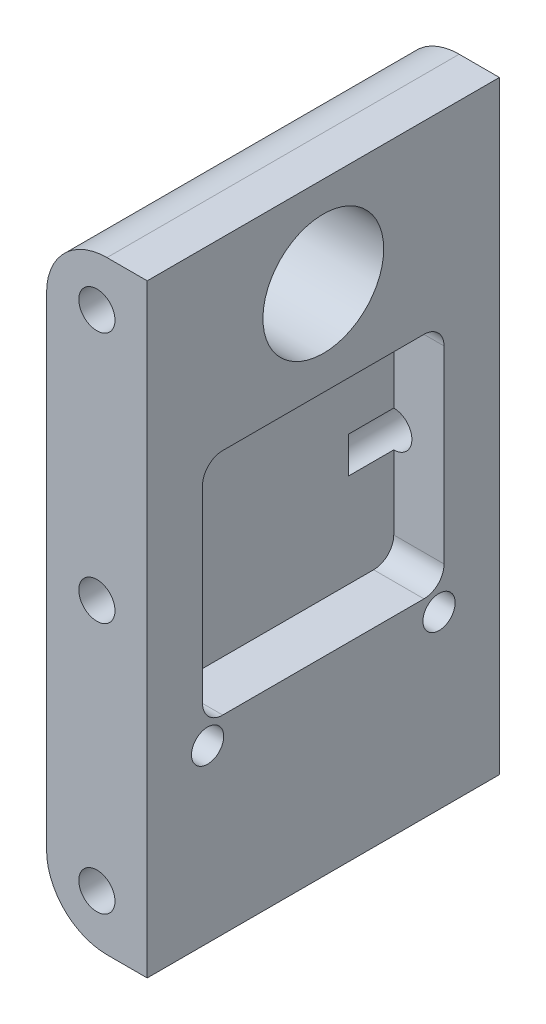
ISO-10303-21;
HEADER;
FILE_DESCRIPTION(('STEP AP214'),'2;1');
FILE_NAME('part.step','',(''),(''),'','','');
FILE_SCHEMA(('AUTOMOTIVE_DESIGN { 1 0 10303 214 1 1 1 1 }'));
ENDSEC;
DATA;
#1=APPLICATION_CONTEXT('core data for automotive mechanical design processes');
#2=APPLICATION_PROTOCOL_DEFINITION('international standard','automotive_design',2000,#1);
#3=PRODUCT_CONTEXT('',#1,'mechanical');
#4=PRODUCT('Part','Part','',(#3));
#5=PRODUCT_RELATED_PRODUCT_CATEGORY('part','',(#4));
#6=PRODUCT_DEFINITION_FORMATION('','',#4);
#7=PRODUCT_DEFINITION_CONTEXT('part definition',#1,'design');
#8=PRODUCT_DEFINITION('design','',#6,#7);
#9=PRODUCT_DEFINITION_SHAPE('','',#8);
#10=(LENGTH_UNIT() NAMED_UNIT(*) SI_UNIT(.MILLI.,.METRE.));
#11=(NAMED_UNIT(*) PLANE_ANGLE_UNIT() SI_UNIT($,.RADIAN.));
#12=(NAMED_UNIT(*) SI_UNIT($,.STERADIAN.) SOLID_ANGLE_UNIT());
#13=UNCERTAINTY_MEASURE_WITH_UNIT(LENGTH_MEASURE(1.E-05),#10,'distance_accuracy_value','');
#14=(GEOMETRIC_REPRESENTATION_CONTEXT(3) GLOBAL_UNCERTAINTY_ASSIGNED_CONTEXT((#13)) GLOBAL_UNIT_ASSIGNED_CONTEXT((#10,
#11,#12)) REPRESENTATION_CONTEXT('',''));
#15=CARTESIAN_POINT('',(0.,0.,0.));
#16=DIRECTION('',(0.,0.,1.));
#17=DIRECTION('',(1.,0.,0.));
#18=AXIS2_PLACEMENT_3D('',#15,#16,#17);
#19=CARTESIAN_POINT('',(10.,0.,0.));
#20=DIRECTION('',(-1.,0.,0.));
#21=DIRECTION('',(0.,0.,1.));
#22=AXIS2_PLACEMENT_3D('',#19,#20,#21);
#23=PLANE('',#22);
#24=DIRECTION('',(0.,0.,1.));
#25=VECTOR('',#24,1.);
#26=CARTESIAN_POINT('',(10.,41.6401580107337,-7.50000000000002));
#27=LINE('',#26,#25);
#28=CARTESIAN_POINT('',(10.,41.6401580107337,-27.5));
#29=VERTEX_POINT('',#28);
#30=CARTESIAN_POINT('',(10.,41.6401580107337,-7.50000000000002));
#31=VERTEX_POINT('',#30);
#32=EDGE_CURVE('E232',#29,#31,#27,.T.);
#33=ORIENTED_EDGE('',*,*,#32,.F.);
#34=CARTESIAN_POINT('',(10.,39.6401580107337,-27.5));
#35=DIRECTION('',(1.,0.,0.));
#36=DIRECTION('',(0.,0.,1.));
#37=AXIS2_PLACEMENT_3D('',#34,#35,#36);
#38=CIRCLE('',#37,2.);
#39=CARTESIAN_POINT('',(10.,39.6401580107337,-29.5));
#40=VERTEX_POINT('',#39);
#41=EDGE_CURVE('E179',#40,#29,#38,.T.);
#42=ORIENTED_EDGE('',*,*,#41,.F.);
#43=DIRECTION('',(0.,1.,0.));
#44=VECTOR('',#43,1.);
#45=CARTESIAN_POINT('',(10.,39.6401580107337,-29.5));
#46=LINE('',#45,#44);
#47=CARTESIAN_POINT('',(10.,20.881008271694,-29.5));
#48=VERTEX_POINT('',#47);
#49=EDGE_CURVE('E201',#48,#40,#46,.T.);
#50=ORIENTED_EDGE('',*,*,#49,.F.);
#51=CARTESIAN_POINT('',(10.,20.881008271694,-27.5));
#52=DIRECTION('',(1.,0.,0.));
#53=DIRECTION('',(0.,0.,1.));
#54=AXIS2_PLACEMENT_3D('',#51,#52,#53);
#55=CIRCLE('',#54,2.);
#56=CARTESIAN_POINT('',(10.,18.881008271694,-27.5));
#57=VERTEX_POINT('',#56);
#58=EDGE_CURVE('E205',#57,#48,#55,.T.);
#59=ORIENTED_EDGE('',*,*,#58,.F.);
#60=DIRECTION('',(0.,0.,-1.));
#61=VECTOR('',#60,1.);
#62=CARTESIAN_POINT('',(10.,18.881008271694,-7.50000000000002));
#63=LINE('',#62,#61);
#64=CARTESIAN_POINT('',(10.,18.881008271694,-7.50000000000002));
#65=VERTEX_POINT('',#64);
#66=EDGE_CURVE('E247',#65,#57,#63,.T.);
#67=ORIENTED_EDGE('',*,*,#66,.F.);
#68=CARTESIAN_POINT('',(10.,20.881008271694,-7.50000000000001));
#69=DIRECTION('',(1.,0.,0.));
#70=DIRECTION('',(0.,0.,-1.));
#71=AXIS2_PLACEMENT_3D('',#68,#69,#70);
#72=CIRCLE('',#71,2.);
#73=CARTESIAN_POINT('',(10.,20.881008271694,-5.50000000000001));
#74=VERTEX_POINT('',#73);
#75=EDGE_CURVE('E243',#74,#65,#72,.T.);
#76=ORIENTED_EDGE('',*,*,#75,.F.);
#77=DIRECTION('',(0.,-1.,0.));
#78=VECTOR('',#77,1.);
#79=CARTESIAN_POINT('',(10.,31.881008271694,-5.50000000000001));
#80=LINE('',#79,#78);
#81=CARTESIAN_POINT('',(10.,39.6401580107337,-5.5));
#82=VERTEX_POINT('',#81);
#83=EDGE_CURVE('E239',#82,#74,#80,.T.);
#84=ORIENTED_EDGE('',*,*,#83,.F.);
#85=CARTESIAN_POINT('',(10.,39.6401580107337,-7.50000000000001));
#86=DIRECTION('',(1.,0.,0.));
#87=DIRECTION('',(0.,0.,1.));
#88=AXIS2_PLACEMENT_3D('',#85,#86,#87);
#89=CIRCLE('',#88,2.);
#90=EDGE_CURVE('E235',#31,#82,#89,.T.);
#91=ORIENTED_EDGE('',*,*,#90,.F.);
#92=EDGE_LOOP('',(#33,#42,#50,#59,#67,#76,#84,#91));
#93=FACE_BOUND('',#92,.T.);
#94=DIRECTION('',(0.,-1.,0.));
#95=VECTOR('',#94,1.);
#96=CARTESIAN_POINT('',(10.,0.,0.));
#97=LINE('',#96,#95);
#98=CARTESIAN_POINT('',(10.,60.,0.));
#99=VERTEX_POINT('',#98);
#100=CARTESIAN_POINT('',(10.,0.,0.));
#101=VERTEX_POINT('',#100);
#102=EDGE_CURVE('E365',#99,#101,#97,.T.);
#103=ORIENTED_EDGE('',*,*,#102,.T.);
#104=DIRECTION('',(0.,0.,-1.));
#105=VECTOR('',#104,1.);
#106=CARTESIAN_POINT('',(10.,0.,0.));
#107=LINE('',#106,#105);
#108=CARTESIAN_POINT('',(10.,0.,-35.));
#109=VERTEX_POINT('',#108);
#110=EDGE_CURVE('E369',#101,#109,#107,.T.);
#111=ORIENTED_EDGE('',*,*,#110,.T.);
#112=DIRECTION('',(0.,1.,0.));
#113=VECTOR('',#112,1.);
#114=CARTESIAN_POINT('',(10.,60.,-35.));
#115=LINE('',#114,#113);
#116=CARTESIAN_POINT('',(10.,60.,-35.));
#117=VERTEX_POINT('',#116);
#118=EDGE_CURVE('E373',#109,#117,#115,.T.);
#119=ORIENTED_EDGE('',*,*,#118,.T.);
#120=DIRECTION('',(0.,0.,1.));
#121=VECTOR('',#120,1.);
#122=CARTESIAN_POINT('',(10.,60.,0.));
#123=LINE('',#122,#121);
#124=EDGE_CURVE('E376',#117,#99,#123,.T.);
#125=ORIENTED_EDGE('',*,*,#124,.T.);
#126=EDGE_LOOP('',(#103,#111,#119,#125));
#127=FACE_BOUND('',#126,.T.);
#128=CARTESIAN_POINT('',(10.,51.,-17.5));
#129=DIRECTION('',(1.,0.,0.));
#130=DIRECTION('',(0.,0.,-1.));
#131=AXIS2_PLACEMENT_3D('',#128,#129,#130);
#132=CIRCLE('',#131,6.);
#133=CARTESIAN_POINT('',(10.,51.,-23.5));
#134=VERTEX_POINT('',#133);
#135=EDGE_CURVE('E358',#134,#134,#132,.T.);
#136=ORIENTED_EDGE('',*,*,#135,.F.);
#137=EDGE_LOOP('',(#136));
#138=FACE_BOUND('',#137,.T.);
#139=CARTESIAN_POINT('',(10.,17.,-6.));
#140=DIRECTION('',(1.,0.,0.));
#141=DIRECTION('',(0.,0.,-1.));
#142=AXIS2_PLACEMENT_3D('',#139,#140,#141);
#143=CIRCLE('',#142,1.6);
#144=CARTESIAN_POINT('',(10.,17.,-7.6));
#145=VERTEX_POINT('',#144);
#146=EDGE_CURVE('E350',#145,#145,#143,.T.);
#147=ORIENTED_EDGE('',*,*,#146,.F.);
#148=EDGE_LOOP('',(#147));
#149=FACE_BOUND('',#148,.T.);
#150=CARTESIAN_POINT('',(10.,17.,-29.));
#151=DIRECTION('',(1.,0.,0.));
#152=DIRECTION('',(0.,0.,-1.));
#153=AXIS2_PLACEMENT_3D('',#150,#151,#152);
#154=CIRCLE('',#153,1.6);
#155=CARTESIAN_POINT('',(10.,17.,-30.6));
#156=VERTEX_POINT('',#155);
#157=EDGE_CURVE('E342',#156,#156,#154,.T.);
#158=ORIENTED_EDGE('',*,*,#157,.F.);
#159=EDGE_LOOP('',(#158));
#160=FACE_BOUND('',#159,.T.);
#161=ADVANCED_FACE('F39',(#93,#127,#138,#149,#160),#23,.F.);
#162=CARTESIAN_POINT('',(0.,0.,0.));
#163=DIRECTION('',(-1.,0.,0.));
#164=DIRECTION('',(0.,0.,1.));
#165=AXIS2_PLACEMENT_3D('',#162,#163,#164);
#166=PLANE('',#165);
#167=CARTESIAN_POINT('',(0.,17.,-6.));
#168=DIRECTION('',(1.,0.,0.));
#169=DIRECTION('',(0.,0.,-1.));
#170=AXIS2_PLACEMENT_3D('',#167,#168,#169);
#171=CIRCLE('',#170,1.6);
#172=CARTESIAN_POINT('',(0.,17.,-7.6));
#173=VERTEX_POINT('',#172);
#174=EDGE_CURVE('E346',#173,#173,#171,.T.);
#175=ORIENTED_EDGE('',*,*,#174,.T.);
#176=EDGE_LOOP('',(#175));
#177=FACE_BOUND('',#176,.T.);
#178=DIRECTION('',(0.,-1.,0.));
#179=VECTOR('',#178,1.);
#180=CARTESIAN_POINT('',(0.,0.,0.));
#181=LINE('',#180,#179);
#182=CARTESIAN_POINT('',(0.,54.,0.));
#183=VERTEX_POINT('',#182);
#184=CARTESIAN_POINT('',(0.,6.,0.));
#185=VERTEX_POINT('',#184);
#186=EDGE_CURVE('E362',#183,#185,#181,.T.);
#187=ORIENTED_EDGE('',*,*,#186,.F.);
#188=DIRECTION('',(0.,0.,1.));
#189=VECTOR('',#188,1.);
#190=CARTESIAN_POINT('',(0.,54.,-35.));
#191=LINE('',#190,#189);
#192=CARTESIAN_POINT('',(0.,54.,-12.3038475772934));
#193=VERTEX_POINT('',#192);
#194=EDGE_CURVE('E62',#183,#193,#191,.F.);
#195=ORIENTED_EDGE('',*,*,#194,.T.);
#196=CARTESIAN_POINT('',(0.,51.,-17.5));
#197=DIRECTION('',(1.,0.,0.));
#198=DIRECTION('',(0.,0.,-1.));
#199=AXIS2_PLACEMENT_3D('',#196,#197,#198);
#200=CIRCLE('',#199,6.);
#201=CARTESIAN_POINT('',(0.,54.,-22.6961524227066));
#202=VERTEX_POINT('',#201);
#203=EDGE_CURVE('E354',#193,#202,#200,.T.);
#204=ORIENTED_EDGE('',*,*,#203,.T.);
#205=DIRECTION('',(0.,0.,1.));
#206=VECTOR('',#205,1.);
#207=CARTESIAN_POINT('',(0.,54.,-35.));
#208=LINE('',#207,#206);
#209=CARTESIAN_POINT('',(0.,54.,-35.));
#210=VERTEX_POINT('',#209);
#211=EDGE_CURVE('E425',#202,#210,#208,.F.);
#212=ORIENTED_EDGE('',*,*,#211,.T.);
#213=DIRECTION('',(0.,1.,0.));
#214=VECTOR('',#213,1.);
#215=CARTESIAN_POINT('',(0.,60.,-35.));
#216=LINE('',#215,#214);
#217=CARTESIAN_POINT('',(0.,6.,-35.));
#218=VERTEX_POINT('',#217);
#219=EDGE_CURVE('E370',#218,#210,#216,.T.);
#220=ORIENTED_EDGE('',*,*,#219,.F.);
#221=DIRECTION('',(0.,0.,-1.));
#222=VECTOR('',#221,1.);
#223=CARTESIAN_POINT('',(0.,6.,0.));
#224=LINE('',#223,#222);
#225=EDGE_CURVE('E422',#218,#185,#224,.F.);
#226=ORIENTED_EDGE('',*,*,#225,.T.);
#227=EDGE_LOOP('',(#187,#195,#204,#212,#220,#226));
#228=FACE_BOUND('',#227,.T.);
#229=CARTESIAN_POINT('',(0.,17.,-29.));
#230=DIRECTION('',(1.,0.,0.));
#231=DIRECTION('',(0.,0.,-1.));
#232=AXIS2_PLACEMENT_3D('',#229,#230,#231);
#233=CIRCLE('',#232,1.6);
#234=CARTESIAN_POINT('',(0.,17.,-30.6));
#235=VERTEX_POINT('',#234);
#236=EDGE_CURVE('E322',#235,#235,#233,.T.);
#237=ORIENTED_EDGE('',*,*,#236,.T.);
#238=EDGE_LOOP('',(#237));
#239=FACE_BOUND('',#238,.T.);
#240=ADVANCED_FACE('F451',(#177,#228,#239),#166,.T.);
#241=CARTESIAN_POINT('',(10.,0.,0.));
#242=DIRECTION('',(0.,0.,-1.));
#243=DIRECTION('',(-1.,0.,0.));
#244=AXIS2_PLACEMENT_3D('',#241,#242,#243);
#245=PLANE('',#244);
#246=CARTESIAN_POINT('',(5.,55.,0.));
#247=DIRECTION('',(0.,0.,1.));
#248=DIRECTION('',(1.,0.,0.));
#249=AXIS2_PLACEMENT_3D('',#246,#247,#248);
#250=CIRCLE('',#249,1.8);
#251=CARTESIAN_POINT('',(6.8,55.,0.));
#252=VERTEX_POINT('',#251);
#253=EDGE_CURVE('E299',#252,#252,#250,.T.);
#254=ORIENTED_EDGE('',*,*,#253,.F.);
#255=EDGE_LOOP('',(#254));
#256=FACE_BOUND('',#255,.T.);
#257=CARTESIAN_POINT('',(5.00000000000026,30.,0.));
#258=DIRECTION('',(0.,0.,1.));
#259=DIRECTION('',(1.,0.,0.));
#260=AXIS2_PLACEMENT_3D('',#257,#258,#259);
#261=CIRCLE('',#260,1.8);
#262=CARTESIAN_POINT('',(6.80000000000026,30.,0.));
#263=VERTEX_POINT('',#262);
#264=EDGE_CURVE('E307',#263,#263,#261,.T.);
#265=ORIENTED_EDGE('',*,*,#264,.F.);
#266=EDGE_LOOP('',(#265));
#267=FACE_BOUND('',#266,.T.);
#268=CARTESIAN_POINT('',(5.00000000000052,5.,0.));
#269=DIRECTION('',(0.,0.,1.));
#270=DIRECTION('',(1.,0.,0.));
#271=AXIS2_PLACEMENT_3D('',#268,#269,#270);
#272=CIRCLE('',#271,1.8);
#273=CARTESIAN_POINT('',(6.80000000000052,5.,0.));
#274=VERTEX_POINT('',#273);
#275=EDGE_CURVE('E293',#274,#274,#272,.T.);
#276=ORIENTED_EDGE('',*,*,#275,.F.);
#277=EDGE_LOOP('',(#276));
#278=FACE_BOUND('',#277,.T.);
#279=DIRECTION('',(-1.,0.,0.));
#280=VECTOR('',#279,1.);
#281=CARTESIAN_POINT('',(10.,60.,0.));
#282=LINE('',#281,#280);
#283=CARTESIAN_POINT('',(6.,60.,0.));
#284=VERTEX_POINT('',#283);
#285=EDGE_CURVE('E379',#99,#284,#282,.T.);
#286=ORIENTED_EDGE('',*,*,#285,.T.);
#287=CARTESIAN_POINT('',(6.,54.,0.));
#288=DIRECTION('',(0.,0.,-1.));
#289=DIRECTION('',(-1.,0.,0.));
#290=AXIS2_PLACEMENT_3D('',#287,#288,#289);
#291=CIRCLE('',#290,6.);
#292=EDGE_CURVE('E419',#284,#183,#291,.F.);
#293=ORIENTED_EDGE('',*,*,#292,.T.);
#294=ORIENTED_EDGE('',*,*,#186,.T.);
#295=CARTESIAN_POINT('',(6.,6.,0.));
#296=DIRECTION('',(0.,0.,-1.));
#297=DIRECTION('',(-1.,0.,0.));
#298=AXIS2_PLACEMENT_3D('',#295,#296,#297);
#299=CIRCLE('',#298,6.);
#300=CARTESIAN_POINT('',(6.,0.,0.));
#301=VERTEX_POINT('',#300);
#302=EDGE_CURVE('E416',#185,#301,#299,.F.);
#303=ORIENTED_EDGE('',*,*,#302,.T.);
#304=DIRECTION('',(-1.,0.,0.));
#305=VECTOR('',#304,1.);
#306=CARTESIAN_POINT('',(10.,0.,0.));
#307=LINE('',#306,#305);
#308=EDGE_CURVE('E397',#101,#301,#307,.T.);
#309=ORIENTED_EDGE('',*,*,#308,.F.);
#310=ORIENTED_EDGE('',*,*,#102,.F.);
#311=EDGE_LOOP('',(#286,#293,#294,#303,#309,#310));
#312=FACE_BOUND('',#311,.T.);
#313=ADVANCED_FACE('F447',(#256,#267,#278,#312),#245,.F.);
#314=CARTESIAN_POINT('',(10.,0.,0.));
#315=DIRECTION('',(0.,1.,0.));
#316=DIRECTION('',(0.,0.,1.));
#317=AXIS2_PLACEMENT_3D('',#314,#315,#316);
#318=PLANE('',#317);
#319=ORIENTED_EDGE('',*,*,#308,.T.);
#320=DIRECTION('',(0.,0.,-1.));
#321=VECTOR('',#320,1.);
#322=CARTESIAN_POINT('',(6.,0.,-35.));
#323=LINE('',#322,#321);
#324=CARTESIAN_POINT('',(6.,0.,-35.));
#325=VERTEX_POINT('',#324);
#326=EDGE_CURVE('E11',#301,#325,#323,.T.);
#327=ORIENTED_EDGE('',*,*,#326,.T.);
#328=DIRECTION('',(-1.,0.,0.));
#329=VECTOR('',#328,1.);
#330=CARTESIAN_POINT('',(10.,0.,-35.));
#331=LINE('',#330,#329);
#332=EDGE_CURVE('E393',#109,#325,#331,.T.);
#333=ORIENTED_EDGE('',*,*,#332,.F.);
#334=ORIENTED_EDGE('',*,*,#110,.F.);
#335=EDGE_LOOP('',(#319,#327,#333,#334));
#336=FACE_BOUND('',#335,.T.);
#337=ADVANCED_FACE('F450',(#336),#318,.F.);
#338=CARTESIAN_POINT('',(10.,60.,-35.));
#339=DIRECTION('',(0.,0.,1.));
#340=DIRECTION('',(1.,0.,0.));
#341=AXIS2_PLACEMENT_3D('',#338,#339,#340);
#342=PLANE('',#341);
#343=CARTESIAN_POINT('',(5.,55.,-35.));
#344=DIRECTION('',(0.,0.,-1.));
#345=DIRECTION('',(-1.,0.,0.));
#346=AXIS2_PLACEMENT_3D('',#343,#344,#345);
#347=CIRCLE('',#346,1.8);
#348=CARTESIAN_POINT('',(3.2,55.,-35.));
#349=VERTEX_POINT('',#348);
#350=EDGE_CURVE('E323',#349,#349,#347,.T.);
#351=ORIENTED_EDGE('',*,*,#350,.F.);
#352=EDGE_LOOP('',(#351));
#353=FACE_BOUND('',#352,.T.);
#354=CARTESIAN_POINT('',(4.99999999999974,30.,-35.));
#355=DIRECTION('',(0.,0.,-1.));
#356=DIRECTION('',(-1.,0.,0.));
#357=AXIS2_PLACEMENT_3D('',#354,#355,#356);
#358=CIRCLE('',#357,1.8);
#359=CARTESIAN_POINT('',(3.19999999999974,30.,-35.));
#360=VERTEX_POINT('',#359);
#361=EDGE_CURVE('E331',#360,#360,#358,.T.);
#362=ORIENTED_EDGE('',*,*,#361,.F.);
#363=EDGE_LOOP('',(#362));
#364=FACE_BOUND('',#363,.T.);
#365=CARTESIAN_POINT('',(4.99999999999948,5.,-35.));
#366=DIRECTION('',(0.,0.,-1.));
#367=DIRECTION('',(-1.,0.,0.));
#368=AXIS2_PLACEMENT_3D('',#365,#366,#367);
#369=CIRCLE('',#368,1.8);
#370=CARTESIAN_POINT('',(3.19999999999948,5.,-35.));
#371=VERTEX_POINT('',#370);
#372=EDGE_CURVE('E298',#371,#371,#369,.T.);
#373=ORIENTED_EDGE('',*,*,#372,.F.);
#374=EDGE_LOOP('',(#373));
#375=FACE_BOUND('',#374,.T.);
#376=ORIENTED_EDGE('',*,*,#219,.T.);
#377=CARTESIAN_POINT('',(6.,54.,-35.));
#378=DIRECTION('',(0.,0.,1.));
#379=DIRECTION('',(1.,0.,0.));
#380=AXIS2_PLACEMENT_3D('',#377,#378,#379);
#381=CIRCLE('',#380,6.);
#382=CARTESIAN_POINT('',(6.,60.,-35.));
#383=VERTEX_POINT('',#382);
#384=EDGE_CURVE('E48',#210,#383,#381,.F.);
#385=ORIENTED_EDGE('',*,*,#384,.T.);
#386=DIRECTION('',(-1.,0.,0.));
#387=VECTOR('',#386,1.);
#388=CARTESIAN_POINT('',(10.,60.,-35.));
#389=LINE('',#388,#387);
#390=EDGE_CURVE('E389',#117,#383,#389,.T.);
#391=ORIENTED_EDGE('',*,*,#390,.F.);
#392=ORIENTED_EDGE('',*,*,#118,.F.);
#393=ORIENTED_EDGE('',*,*,#332,.T.);
#394=CARTESIAN_POINT('',(6.,6.,-35.));
#395=DIRECTION('',(0.,0.,1.));
#396=DIRECTION('',(1.,0.,0.));
#397=AXIS2_PLACEMENT_3D('',#394,#395,#396);
#398=CIRCLE('',#397,6.);
#399=EDGE_CURVE('E55',#325,#218,#398,.F.);
#400=ORIENTED_EDGE('',*,*,#399,.T.);
#401=EDGE_LOOP('',(#376,#385,#391,#392,#393,#400));
#402=FACE_BOUND('',#401,.T.);
#403=ADVANCED_FACE('F455',(#353,#364,#375,#402),#342,.F.);
#404=CARTESIAN_POINT('',(10.,60.,0.));
#405=DIRECTION('',(0.,-1.,0.));
#406=DIRECTION('',(0.,0.,-1.));
#407=AXIS2_PLACEMENT_3D('',#404,#405,#406);
#408=PLANE('',#407);
#409=ORIENTED_EDGE('',*,*,#390,.T.);
#410=DIRECTION('',(0.,0.,1.));
#411=VECTOR('',#410,1.);
#412=CARTESIAN_POINT('',(6.,60.,0.));
#413=LINE('',#412,#411);
#414=EDGE_CURVE('E412',#383,#284,#413,.T.);
#415=ORIENTED_EDGE('',*,*,#414,.T.);
#416=ORIENTED_EDGE('',*,*,#285,.F.);
#417=ORIENTED_EDGE('',*,*,#124,.F.);
#418=EDGE_LOOP('',(#409,#415,#416,#417));
#419=FACE_BOUND('',#418,.T.);
#420=ADVANCED_FACE('F459',(#419),#408,.F.);
#421=CARTESIAN_POINT('',(10.,51.,-17.5));
#422=DIRECTION('',(-1.,0.,0.));
#423=DIRECTION('',(0.,0.,1.));
#424=AXIS2_PLACEMENT_3D('',#421,#422,#423);
#425=CYLINDRICAL_SURFACE('',#424,6.);
#426=ORIENTED_EDGE('',*,*,#135,.T.);
#427=EDGE_LOOP('',(#426));
#428=FACE_BOUND('',#427,.T.);
#429=ORIENTED_EDGE('',*,*,#203,.F.);
#430=CARTESIAN_POINT('',(0.,54.,-12.3038475772934));
#431=CARTESIAN_POINT('',(-1.70318691964767E-05,54.138971489971,-12.3840486609694));
#432=CARTESIAN_POINT('',(0.004826564341127,54.2746087440341,-12.4698234963983));
#433=CARTESIAN_POINT('',(0.0227239424648481,54.5380740534339,-12.6515453539032));
#434=CARTESIAN_POINT('',(0.0357670906650158,54.6659119882295,-12.747479067494));
#435=CARTESIAN_POINT('',(0.0684624467663157,54.9122658926771,-12.9481552580847));
#436=CARTESIAN_POINT('',(0.0880747779846383,55.0308329071765,-13.0528417927466));
#437=CARTESIAN_POINT('',(0.132395671677967,55.2588578109537,-13.2706941914864));
#438=CARTESIAN_POINT('',(0.157105871638557,55.3683127574512,-13.3838627726258));
#439=CARTESIAN_POINT('',(0.2363738701154,55.6812857302597,-13.7339552919189));
#440=CARTESIAN_POINT('',(0.296277933209233,55.8707497970105,-13.9825625930407));
#441=CARTESIAN_POINT('',(0.387873584499626,56.1241866180133,-14.3747622922179));
#442=CARTESIAN_POINT('',(0.418742446001198,56.2036338384799,-14.508923554784));
#443=CARTESIAN_POINT('',(0.479610319044134,56.3519592810563,-14.7832350066012));
#444=CARTESIAN_POINT('',(0.50960924488321,56.4208364647014,-14.9233857825714));
#445=CARTESIAN_POINT('',(0.57008725692433,56.553801168399,-15.2230007441497));
#446=CARTESIAN_POINT('',(0.600326834879387,56.6167630432964,-15.3830139628661));
#447=CARTESIAN_POINT('',(0.656120625714184,56.7288967700485,-15.708533221189));
#448=CARTESIAN_POINT('',(0.681676907906104,56.7780747174361,-15.874036796521));
#449=CARTESIAN_POINT('',(0.726396540192259,56.8620575418262,-16.2092319722415));
#450=CARTESIAN_POINT('',(0.745569989964516,56.8968851466135,-16.3789164956155));
#451=CARTESIAN_POINT('',(0.7762114546111,56.9517844390372,-16.721339033517));
#452=CARTESIAN_POINT('',(0.787680699206749,56.9718584816397,-16.8940765562146));
#453=CARTESIAN_POINT('',(0.801430111553232,56.9958369707298,-17.2258699949614));
#454=CARTESIAN_POINT('',(0.804423916108371,57.0009979900945,-17.3848064852442));
#455=CARTESIAN_POINT('',(0.803087652985968,56.9986840201315,-17.7025528520796));
#456=CARTESIAN_POINT('',(0.798757931373836,56.9912096278766,-17.8613627342602));
#457=CARTESIAN_POINT('',(0.783051709346282,56.9637303076266,-18.1775843979837));
#458=CARTESIAN_POINT('',(0.771672956141471,56.9437213737133,-18.3349957162419));
#459=CARTESIAN_POINT('',(0.74258001036149,56.8914400770858,-18.6471630649126));
#460=CARTESIAN_POINT('',(0.724865730184451,56.8591675448015,-18.8019190585787));
#461=CARTESIAN_POINT('',(0.685478607930235,56.7852280548295,-19.0977630415463));
#462=CARTESIAN_POINT('',(0.664139298092433,56.7443110873645,-19.2390841758154));
#463=CARTESIAN_POINT('',(0.617873224520897,56.6524235210254,-19.5178348107684));
#464=CARTESIAN_POINT('',(0.592945361557728,56.601449839845,-19.6552631035213));
#465=CARTESIAN_POINT('',(0.514428407863169,56.4338799823086,-20.0609774484928));
#466=CARTESIAN_POINT('',(0.457117523498166,56.3026548260349,-20.322614360533));
#467=CARTESIAN_POINT('',(0.334333473326662,55.9832379765415,-20.858159459369));
#468=CARTESIAN_POINT('',(0.268807912423602,55.7897327274657,-21.1289159349087));
#469=CARTESIAN_POINT('',(0.181050536064394,55.4670543183315,-21.5091186441178));
#470=CARTESIAN_POINT('',(0.153568408184191,55.3541794816466,-21.6314562222759));
#471=CARTESIAN_POINT('',(0.103862999574718,55.118083219865,-21.8668238822048));
#472=CARTESIAN_POINT('',(0.081637108831873,54.9948669712111,-21.9798585651222));
#473=CARTESIAN_POINT('',(0.0433054162393705,54.7322837248737,-22.2011658255451));
#474=CARTESIAN_POINT('',(0.0275648439157112,54.5924155759533,-22.3089106488047));
#475=CARTESIAN_POINT('',(0.0058941424161629,54.3030711086184,-22.5121006928568));
#476=CARTESIAN_POINT('',(-2.41089792427208E-05,54.1535833840671,-22.6075308936609));
#477=CARTESIAN_POINT('',(0.,54.,-22.6961524227066));
#478=B_SPLINE_CURVE_WITH_KNOTS('',3,(#430,#431,#432,#433,#434,#435,#436,#437,#438,#439,#440,
#441,#442,#443,#444,#445,#446,#447,#448,#449,#450,#451,#452,#453,#454,#455,#456,#457,#458,#459,
#460,#461,#462,#463,#464,#465,#466,#467,#468,#469,#470,#471,#472,#473,#474,#475,#476,#477),
.UNSPECIFIED.,.F.,.F.,(4,2,2,2,2,2,2,2,2,2,2,2,2,2,2,2,2,2,2,2,2,2,2,4),(0.,0.481007244724744,
0.96139197115481,1.43891194475274,1.91658554194476,2.86676478085739,3.34326908663013,
3.81982017715403,4.34293663731535,4.86582139843953,5.38787481215915,5.90984487751972,
6.38633112647706,6.86279486021444,7.33941094489037,7.816033620032,8.26157062121815,
8.70724438883857,9.5988350843745,10.6113996532194,11.1169923893763,11.6223335410446,
12.1531632104413,12.6846343266553),.UNSPECIFIED.);
#479=EDGE_CURVE('E430',#193,#202,#478,.T.);
#480=ORIENTED_EDGE('',*,*,#479,.T.);
#481=EDGE_LOOP('',(#429,#480));
#482=FACE_BOUND('',#481,.T.);
#483=ADVANCED_FACE('F438',(#428,#482),#425,.F.);
#484=CARTESIAN_POINT('',(10.,17.,-6.));
#485=DIRECTION('',(-1.,0.,0.));
#486=DIRECTION('',(0.,0.,1.));
#487=AXIS2_PLACEMENT_3D('',#484,#485,#486);
#488=CYLINDRICAL_SURFACE('',#487,1.6);
#489=ORIENTED_EDGE('',*,*,#146,.T.);
#490=EDGE_LOOP('',(#489));
#491=FACE_BOUND('',#490,.T.);
#492=ORIENTED_EDGE('',*,*,#174,.F.);
#493=EDGE_LOOP('',(#492));
#494=FACE_BOUND('',#493,.T.);
#495=ADVANCED_FACE('F485',(#491,#494),#488,.F.);
#496=CARTESIAN_POINT('',(10.,17.,-29.));
#497=DIRECTION('',(-1.,0.,0.));
#498=DIRECTION('',(0.,0.,1.));
#499=AXIS2_PLACEMENT_3D('',#496,#497,#498);
#500=CYLINDRICAL_SURFACE('',#499,1.6);
#501=ORIENTED_EDGE('',*,*,#157,.T.);
#502=EDGE_LOOP('',(#501));
#503=FACE_BOUND('',#502,.T.);
#504=ORIENTED_EDGE('',*,*,#236,.F.);
#505=EDGE_LOOP('',(#504));
#506=FACE_BOUND('',#505,.T.);
#507=ADVANCED_FACE('F481',(#503,#506),#500,.F.);
#508=CARTESIAN_POINT('',(4.99999999999948,5.,-25.));
#509=DIRECTION('',(0.,0.,-1.));
#510=DIRECTION('',(-1.,0.,0.));
#511=AXIS2_PLACEMENT_3D('',#508,#509,#510);
#512=CYLINDRICAL_SURFACE('',#511,1.8);
#513=CARTESIAN_POINT('',(4.99999999999948,5.,-25.));
#514=DIRECTION('',(0.,0.,-1.));
#515=DIRECTION('',(-1.,0.,0.));
#516=AXIS2_PLACEMENT_3D('',#513,#514,#515);
#517=CIRCLE('',#516,1.8);
#518=CARTESIAN_POINT('',(3.19999999999948,5.,-25.));
#519=VERTEX_POINT('',#518);
#520=EDGE_CURVE('E335',#519,#519,#517,.T.);
#521=ORIENTED_EDGE('',*,*,#520,.F.);
#522=EDGE_LOOP('',(#521));
#523=FACE_BOUND('',#522,.T.);
#524=ORIENTED_EDGE('',*,*,#372,.T.);
#525=EDGE_LOOP('',(#524));
#526=FACE_BOUND('',#525,.T.);
#527=ADVANCED_FACE('F484',(#523,#526),#512,.F.);
#528=CARTESIAN_POINT('',(4.99999999999948,5.,-25.));
#529=DIRECTION('',(0.,0.,-1.));
#530=DIRECTION('',(-1.,0.,0.));
#531=AXIS2_PLACEMENT_3D('',#528,#529,#530);
#532=PLANE('',#531);
#533=ORIENTED_EDGE('',*,*,#520,.T.);
#534=EDGE_LOOP('',(#533));
#535=FACE_BOUND('',#534,.T.);
#536=ADVANCED_FACE('F493',(#535),#532,.T.);
#537=CARTESIAN_POINT('',(4.99999999999974,30.,-25.));
#538=DIRECTION('',(0.,0.,-1.));
#539=DIRECTION('',(-1.,0.,0.));
#540=AXIS2_PLACEMENT_3D('',#537,#538,#539);
#541=CYLINDRICAL_SURFACE('',#540,1.8);
#542=CARTESIAN_POINT('',(4.99999999999974,30.,-29.5));
#543=DIRECTION('',(0.,0.,-1.));
#544=DIRECTION('',(-1.,0.,0.));
#545=AXIS2_PLACEMENT_3D('',#542,#543,#544);
#546=CIRCLE('',#545,1.8);
#547=CARTESIAN_POINT('',(5.,28.2,-29.5));
#548=VERTEX_POINT('',#547);
#549=CARTESIAN_POINT('',(5.,31.8,-29.5));
#550=VERTEX_POINT('',#549);
#551=EDGE_CURVE('E408',#548,#550,#546,.F.);
#552=ORIENTED_EDGE('',*,*,#551,.T.);
#553=DIRECTION('',(0.,0.,-1.));
#554=VECTOR('',#553,1.);
#555=CARTESIAN_POINT('',(5.,31.8,-25.));
#556=LINE('',#555,#554);
#557=CARTESIAN_POINT('',(4.99999999999974,31.8,-25.));
#558=VERTEX_POINT('',#557);
#559=EDGE_CURVE('E289',#550,#558,#556,.F.);
#560=ORIENTED_EDGE('',*,*,#559,.T.);
#561=CARTESIAN_POINT('',(4.99999999999974,30.,-25.));
#562=DIRECTION('',(0.,0.,-1.));
#563=DIRECTION('',(-1.,0.,0.));
#564=AXIS2_PLACEMENT_3D('',#561,#562,#563);
#565=CIRCLE('',#564,1.8);
#566=CARTESIAN_POINT('',(4.99999999999974,28.2,-25.));
#567=VERTEX_POINT('',#566);
#568=EDGE_CURVE('E327',#567,#558,#565,.T.);
#569=ORIENTED_EDGE('',*,*,#568,.F.);
#570=DIRECTION('',(0.,0.,-1.));
#571=VECTOR('',#570,1.);
#572=CARTESIAN_POINT('',(5.,28.2,-25.));
#573=LINE('',#572,#571);
#574=EDGE_CURVE('E285',#567,#548,#573,.T.);
#575=ORIENTED_EDGE('',*,*,#574,.T.);
#576=EDGE_LOOP('',(#552,#560,#569,#575));
#577=FACE_BOUND('',#576,.T.);
#578=ORIENTED_EDGE('',*,*,#361,.T.);
#579=EDGE_LOOP('',(#578));
#580=FACE_BOUND('',#579,.T.);
#581=ADVANCED_FACE('F500',(#577,#580),#541,.F.);
#582=CARTESIAN_POINT('',(4.99999999999974,30.,-25.));
#583=DIRECTION('',(0.,0.,-1.));
#584=DIRECTION('',(-1.,0.,0.));
#585=AXIS2_PLACEMENT_3D('',#582,#583,#584);
#586=PLANE('',#585);
#587=DIRECTION('',(0.,1.,0.));
#588=VECTOR('',#587,1.);
#589=CARTESIAN_POINT('',(4.99999999999974,30.,-25.));
#590=LINE('',#589,#588);
#591=EDGE_CURVE('E282',#567,#558,#590,.T.);
#592=ORIENTED_EDGE('',*,*,#591,.F.);
#593=ORIENTED_EDGE('',*,*,#568,.T.);
#594=EDGE_LOOP('',(#592,#593));
#595=FACE_BOUND('',#594,.T.);
#596=ADVANCED_FACE('F504',(#595),#586,.T.);
#597=CARTESIAN_POINT('',(5.,55.,-25.));
#598=DIRECTION('',(0.,0.,-1.));
#599=DIRECTION('',(-1.,0.,0.));
#600=AXIS2_PLACEMENT_3D('',#597,#598,#599);
#601=CYLINDRICAL_SURFACE('',#600,1.8);
#602=CARTESIAN_POINT('',(5.,55.,-25.));
#603=DIRECTION('',(0.,0.,-1.));
#604=DIRECTION('',(-1.,0.,0.));
#605=AXIS2_PLACEMENT_3D('',#602,#603,#604);
#606=CIRCLE('',#605,1.8);
#607=CARTESIAN_POINT('',(3.2,55.,-25.));
#608=VERTEX_POINT('',#607);
#609=EDGE_CURVE('E318',#608,#608,#606,.T.);
#610=ORIENTED_EDGE('',*,*,#609,.F.);
#611=EDGE_LOOP('',(#610));
#612=FACE_BOUND('',#611,.T.);
#613=ORIENTED_EDGE('',*,*,#350,.T.);
#614=EDGE_LOOP('',(#613));
#615=FACE_BOUND('',#614,.T.);
#616=ADVANCED_FACE('F508',(#612,#615),#601,.F.);
#617=CARTESIAN_POINT('',(5.,55.,-25.));
#618=DIRECTION('',(0.,0.,-1.));
#619=DIRECTION('',(-1.,0.,0.));
#620=AXIS2_PLACEMENT_3D('',#617,#618,#619);
#621=PLANE('',#620);
#622=ORIENTED_EDGE('',*,*,#609,.T.);
#623=EDGE_LOOP('',(#622));
#624=FACE_BOUND('',#623,.T.);
#625=ADVANCED_FACE('F512',(#624),#621,.T.);
#626=CARTESIAN_POINT('',(5.00000000000052,5.,-10.));
#627=DIRECTION('',(0.,0.,1.));
#628=DIRECTION('',(1.,0.,0.));
#629=AXIS2_PLACEMENT_3D('',#626,#627,#628);
#630=CYLINDRICAL_SURFACE('',#629,1.8);
#631=CARTESIAN_POINT('',(5.00000000000052,5.,-10.));
#632=DIRECTION('',(0.,0.,1.));
#633=DIRECTION('',(1.,0.,0.));
#634=AXIS2_PLACEMENT_3D('',#631,#632,#633);
#635=CIRCLE('',#634,1.8);
#636=CARTESIAN_POINT('',(6.80000000000052,5.,-10.));
#637=VERTEX_POINT('',#636);
#638=EDGE_CURVE('E311',#637,#637,#635,.T.);
#639=ORIENTED_EDGE('',*,*,#638,.F.);
#640=EDGE_LOOP('',(#639));
#641=FACE_BOUND('',#640,.T.);
#642=ORIENTED_EDGE('',*,*,#275,.T.);
#643=EDGE_LOOP('',(#642));
#644=FACE_BOUND('',#643,.T.);
#645=ADVANCED_FACE('F516',(#641,#644),#630,.F.);
#646=CARTESIAN_POINT('',(5.00000000000052,5.,-10.));
#647=DIRECTION('',(0.,0.,1.));
#648=DIRECTION('',(1.,0.,0.));
#649=AXIS2_PLACEMENT_3D('',#646,#647,#648);
#650=PLANE('',#649);
#651=ORIENTED_EDGE('',*,*,#638,.T.);
#652=EDGE_LOOP('',(#651));
#653=FACE_BOUND('',#652,.T.);
#654=ADVANCED_FACE('F520',(#653),#650,.T.);
#655=CARTESIAN_POINT('',(5.00000000000026,30.,-10.));
#656=DIRECTION('',(0.,0.,1.));
#657=DIRECTION('',(1.,0.,0.));
#658=AXIS2_PLACEMENT_3D('',#655,#656,#657);
#659=CYLINDRICAL_SURFACE('',#658,1.8);
#660=CARTESIAN_POINT('',(5.00000000000026,30.,-5.50000000000001));
#661=DIRECTION('',(0.,0.,1.));
#662=DIRECTION('',(1.,0.,0.));
#663=AXIS2_PLACEMENT_3D('',#660,#661,#662);
#664=CIRCLE('',#663,1.8);
#665=CARTESIAN_POINT('',(5.,31.8,-5.50000000000001));
#666=VERTEX_POINT('',#665);
#667=CARTESIAN_POINT('',(5.,28.2,-5.50000000000001));
#668=VERTEX_POINT('',#667);
#669=EDGE_CURVE('E404',#666,#668,#664,.F.);
#670=ORIENTED_EDGE('',*,*,#669,.T.);
#671=DIRECTION('',(0.,0.,1.));
#672=VECTOR('',#671,1.);
#673=CARTESIAN_POINT('',(5.,28.2,-10.));
#674=LINE('',#673,#672);
#675=CARTESIAN_POINT('',(5.00000000000026,28.2,-10.));
#676=VERTEX_POINT('',#675);
#677=EDGE_CURVE('E278',#668,#676,#674,.F.);
#678=ORIENTED_EDGE('',*,*,#677,.T.);
#679=CARTESIAN_POINT('',(5.00000000000026,30.,-10.));
#680=DIRECTION('',(0.,0.,1.));
#681=DIRECTION('',(1.,0.,0.));
#682=AXIS2_PLACEMENT_3D('',#679,#680,#681);
#683=CIRCLE('',#682,1.8);
#684=CARTESIAN_POINT('',(5.00000000000026,31.8,-10.));
#685=VERTEX_POINT('',#684);
#686=EDGE_CURVE('E303',#685,#676,#683,.T.);
#687=ORIENTED_EDGE('',*,*,#686,.F.);
#688=DIRECTION('',(0.,0.,1.));
#689=VECTOR('',#688,1.);
#690=CARTESIAN_POINT('',(5.,31.8,-10.));
#691=LINE('',#690,#689);
#692=EDGE_CURVE('E257',#685,#666,#691,.T.);
#693=ORIENTED_EDGE('',*,*,#692,.T.);
#694=EDGE_LOOP('',(#670,#678,#687,#693));
#695=FACE_BOUND('',#694,.T.);
#696=ORIENTED_EDGE('',*,*,#264,.T.);
#697=EDGE_LOOP('',(#696));
#698=FACE_BOUND('',#697,.T.);
#699=ADVANCED_FACE('F524',(#695,#698),#659,.F.);
#700=CARTESIAN_POINT('',(5.00000000000026,30.,-10.));
#701=DIRECTION('',(0.,0.,1.));
#702=DIRECTION('',(1.,0.,0.));
#703=AXIS2_PLACEMENT_3D('',#700,#701,#702);
#704=PLANE('',#703);
#705=DIRECTION('',(0.,-1.,0.));
#706=VECTOR('',#705,1.);
#707=CARTESIAN_POINT('',(5.00000000000026,30.,-10.));
#708=LINE('',#707,#706);
#709=EDGE_CURVE('E401',#685,#676,#708,.T.);
#710=ORIENTED_EDGE('',*,*,#709,.F.);
#711=ORIENTED_EDGE('',*,*,#686,.T.);
#712=EDGE_LOOP('',(#710,#711));
#713=FACE_BOUND('',#712,.T.);
#714=ADVANCED_FACE('F528',(#713),#704,.T.);
#715=CARTESIAN_POINT('',(5.,55.,-10.));
#716=DIRECTION('',(0.,0.,1.));
#717=DIRECTION('',(1.,0.,0.));
#718=AXIS2_PLACEMENT_3D('',#715,#716,#717);
#719=CYLINDRICAL_SURFACE('',#718,1.8);
#720=CARTESIAN_POINT('',(5.,55.,-10.));
#721=DIRECTION('',(0.,0.,1.));
#722=DIRECTION('',(1.,0.,0.));
#723=AXIS2_PLACEMENT_3D('',#720,#721,#722);
#724=CIRCLE('',#723,1.8);
#725=CARTESIAN_POINT('',(6.8,55.,-10.));
#726=VERTEX_POINT('',#725);
#727=EDGE_CURVE('E294',#726,#726,#724,.T.);
#728=ORIENTED_EDGE('',*,*,#727,.F.);
#729=EDGE_LOOP('',(#728));
#730=FACE_BOUND('',#729,.T.);
#731=ORIENTED_EDGE('',*,*,#253,.T.);
#732=EDGE_LOOP('',(#731));
#733=FACE_BOUND('',#732,.T.);
#734=ADVANCED_FACE('F532',(#730,#733),#719,.F.);
#735=CARTESIAN_POINT('',(5.,55.,-10.));
#736=DIRECTION('',(0.,0.,1.));
#737=DIRECTION('',(1.,0.,0.));
#738=AXIS2_PLACEMENT_3D('',#735,#736,#737);
#739=PLANE('',#738);
#740=ORIENTED_EDGE('',*,*,#727,.T.);
#741=EDGE_LOOP('',(#740));
#742=FACE_BOUND('',#741,.T.);
#743=ADVANCED_FACE('F536',(#742),#739,.T.);
#744=CARTESIAN_POINT('',(5.,39.6401580107337,-29.5));
#745=DIRECTION('',(0.,0.,-1.));
#746=DIRECTION('',(-1.,0.,0.));
#747=AXIS2_PLACEMENT_3D('',#744,#745,#746);
#748=PLANE('',#747);
#749=DIRECTION('',(0.,1.,0.));
#750=VECTOR('',#749,1.);
#751=CARTESIAN_POINT('',(5.,31.881008271694,-29.5));
#752=LINE('',#751,#750);
#753=CARTESIAN_POINT('',(5.,20.881008271694,-29.5));
#754=VERTEX_POINT('',#753);
#755=EDGE_CURVE('E185',#754,#548,#752,.T.);
#756=ORIENTED_EDGE('',*,*,#755,.F.);
#757=DIRECTION('',(1.,0.,0.));
#758=VECTOR('',#757,1.);
#759=CARTESIAN_POINT('',(5.,20.881008271694,-29.5));
#760=LINE('',#759,#758);
#761=EDGE_CURVE('E258',#754,#48,#760,.T.);
#762=ORIENTED_EDGE('',*,*,#761,.T.);
#763=ORIENTED_EDGE('',*,*,#49,.T.);
#764=DIRECTION('',(1.,0.,0.));
#765=VECTOR('',#764,1.);
#766=CARTESIAN_POINT('',(5.,39.6401580107337,-29.5));
#767=LINE('',#766,#765);
#768=CARTESIAN_POINT('',(5.,39.6401580107337,-29.5));
#769=VERTEX_POINT('',#768);
#770=EDGE_CURVE('E254',#769,#40,#767,.T.);
#771=ORIENTED_EDGE('',*,*,#770,.F.);
#772=EDGE_CURVE('E198',#550,#769,#752,.T.);
#773=ORIENTED_EDGE('',*,*,#772,.F.);
#774=ORIENTED_EDGE('',*,*,#551,.F.);
#775=EDGE_LOOP('',(#756,#762,#763,#771,#773,#774));
#776=FACE_BOUND('',#775,.T.);
#777=ADVANCED_FACE('F540',(#776),#748,.F.);
#778=CARTESIAN_POINT('',(5.,31.881008271694,-5.50000000000001));
#779=DIRECTION('',(0.,0.,1.));
#780=DIRECTION('',(1.,0.,0.));
#781=AXIS2_PLACEMENT_3D('',#778,#779,#780);
#782=PLANE('',#781);
#783=DIRECTION('',(0.,-1.,0.));
#784=VECTOR('',#783,1.);
#785=CARTESIAN_POINT('',(5.,36.6401580107337,-5.50000000000001));
#786=LINE('',#785,#784);
#787=CARTESIAN_POINT('',(5.,39.6401580107337,-5.5));
#788=VERTEX_POINT('',#787);
#789=EDGE_CURVE('E211',#788,#666,#786,.T.);
#790=ORIENTED_EDGE('',*,*,#789,.F.);
#791=DIRECTION('',(1.,0.,0.));
#792=VECTOR('',#791,1.);
#793=CARTESIAN_POINT('',(5.,39.6401580107337,-5.5));
#794=LINE('',#793,#792);
#795=EDGE_CURVE('E270',#788,#82,#794,.T.);
#796=ORIENTED_EDGE('',*,*,#795,.T.);
#797=ORIENTED_EDGE('',*,*,#83,.T.);
#798=DIRECTION('',(1.,0.,0.));
#799=VECTOR('',#798,1.);
#800=CARTESIAN_POINT('',(5.,20.881008271694,-5.50000000000001));
#801=LINE('',#800,#799);
#802=CARTESIAN_POINT('',(5.,20.881008271694,-5.50000000000001));
#803=VERTEX_POINT('',#802);
#804=EDGE_CURVE('E267',#803,#74,#801,.T.);
#805=ORIENTED_EDGE('',*,*,#804,.F.);
#806=EDGE_CURVE('E210',#668,#803,#786,.T.);
#807=ORIENTED_EDGE('',*,*,#806,.F.);
#808=ORIENTED_EDGE('',*,*,#669,.F.);
#809=EDGE_LOOP('',(#790,#796,#797,#805,#807,#808));
#810=FACE_BOUND('',#809,.T.);
#811=ADVANCED_FACE('F552',(#810),#782,.F.);
#812=CARTESIAN_POINT('',(5.,39.6401580107337,-27.5));
#813=DIRECTION('',(-1.,0.,0.));
#814=DIRECTION('',(0.,0.,1.));
#815=AXIS2_PLACEMENT_3D('',#812,#813,#814);
#816=PLANE('',#815);
#817=ORIENTED_EDGE('',*,*,#772,.T.);
#818=CARTESIAN_POINT('',(5.,39.6401580107337,-27.5));
#819=DIRECTION('',(1.,0.,0.));
#820=DIRECTION('',(0.,0.,1.));
#821=AXIS2_PLACEMENT_3D('',#818,#819,#820);
#822=CIRCLE('',#821,2.);
#823=CARTESIAN_POINT('',(5.,41.6401580107337,-27.5));
#824=VERTEX_POINT('',#823);
#825=EDGE_CURVE('E177',#769,#824,#822,.T.);
#826=ORIENTED_EDGE('',*,*,#825,.T.);
#827=DIRECTION('',(0.,0.,1.));
#828=VECTOR('',#827,1.);
#829=CARTESIAN_POINT('',(5.,41.6401580107337,-7.50000000000002));
#830=LINE('',#829,#828);
#831=CARTESIAN_POINT('',(5.,41.6401580107337,-7.50000000000002));
#832=VERTEX_POINT('',#831);
#833=EDGE_CURVE('E188',#824,#832,#830,.T.);
#834=ORIENTED_EDGE('',*,*,#833,.T.);
#835=CARTESIAN_POINT('',(5.,39.6401580107337,-7.50000000000001));
#836=DIRECTION('',(1.,0.,0.));
#837=DIRECTION('',(0.,0.,1.));
#838=AXIS2_PLACEMENT_3D('',#835,#836,#837);
#839=CIRCLE('',#838,2.);
#840=EDGE_CURVE('E194',#832,#788,#839,.T.);
#841=ORIENTED_EDGE('',*,*,#840,.T.);
#842=ORIENTED_EDGE('',*,*,#789,.T.);
#843=ORIENTED_EDGE('',*,*,#692,.F.);
#844=ORIENTED_EDGE('',*,*,#709,.T.);
#845=ORIENTED_EDGE('',*,*,#677,.F.);
#846=ORIENTED_EDGE('',*,*,#806,.T.);
#847=CARTESIAN_POINT('',(5.,20.881008271694,-7.50000000000001));
#848=DIRECTION('',(1.,0.,0.));
#849=DIRECTION('',(0.,0.,-1.));
#850=AXIS2_PLACEMENT_3D('',#847,#848,#849);
#851=CIRCLE('',#850,2.);
#852=CARTESIAN_POINT('',(5.,18.881008271694,-7.50000000000002));
#853=VERTEX_POINT('',#852);
#854=EDGE_CURVE('E215',#803,#853,#851,.T.);
#855=ORIENTED_EDGE('',*,*,#854,.T.);
#856=DIRECTION('',(0.,0.,-1.));
#857=VECTOR('',#856,1.);
#858=CARTESIAN_POINT('',(5.,18.881008271694,-7.50000000000002));
#859=LINE('',#858,#857);
#860=CARTESIAN_POINT('',(5.,18.881008271694,-27.5));
#861=VERTEX_POINT('',#860);
#862=EDGE_CURVE('E219',#853,#861,#859,.T.);
#863=ORIENTED_EDGE('',*,*,#862,.T.);
#864=CARTESIAN_POINT('',(5.,20.881008271694,-27.5));
#865=DIRECTION('',(1.,0.,0.));
#866=DIRECTION('',(0.,0.,1.));
#867=AXIS2_PLACEMENT_3D('',#864,#865,#866);
#868=CIRCLE('',#867,2.);
#869=EDGE_CURVE('E223',#861,#754,#868,.T.);
#870=ORIENTED_EDGE('',*,*,#869,.T.);
#871=ORIENTED_EDGE('',*,*,#755,.T.);
#872=ORIENTED_EDGE('',*,*,#574,.F.);
#873=ORIENTED_EDGE('',*,*,#591,.T.);
#874=ORIENTED_EDGE('',*,*,#559,.F.);
#875=EDGE_LOOP('',(#817,#826,#834,#841,#842,#843,#844,#845,#846,#855,#863,#870,#871,#872,#873,#874));
#876=FACE_BOUND('',#875,.T.);
#877=ADVANCED_FACE('F196',(#876),#816,.F.);
#878=CARTESIAN_POINT('',(5.,39.6401580107337,-27.5));
#879=DIRECTION('',(1.,0.,0.));
#880=DIRECTION('',(0.,0.,-1.));
#881=AXIS2_PLACEMENT_3D('',#878,#879,#880);
#882=CYLINDRICAL_SURFACE('',#881,2.);
#883=ORIENTED_EDGE('',*,*,#41,.T.);
#884=DIRECTION('',(1.,0.,0.));
#885=VECTOR('',#884,1.);
#886=CARTESIAN_POINT('',(5.,41.6401580107337,-27.5));
#887=LINE('',#886,#885);
#888=EDGE_CURVE('E173',#824,#29,#887,.T.);
#889=ORIENTED_EDGE('',*,*,#888,.F.);
#890=ORIENTED_EDGE('',*,*,#825,.F.);
#891=ORIENTED_EDGE('',*,*,#770,.T.);
#892=EDGE_LOOP('',(#883,#889,#890,#891));
#893=FACE_BOUND('',#892,.T.);
#894=ADVANCED_FACE('F175',(#893),#882,.F.);
#895=CARTESIAN_POINT('',(5.,20.881008271694,-27.5));
#896=DIRECTION('',(1.,0.,0.));
#897=DIRECTION('',(0.,0.,-1.));
#898=AXIS2_PLACEMENT_3D('',#895,#896,#897);
#899=CYLINDRICAL_SURFACE('',#898,2.);
#900=ORIENTED_EDGE('',*,*,#58,.T.);
#901=ORIENTED_EDGE('',*,*,#761,.F.);
#902=ORIENTED_EDGE('',*,*,#869,.F.);
#903=DIRECTION('',(1.,0.,0.));
#904=VECTOR('',#903,1.);
#905=CARTESIAN_POINT('',(5.,18.881008271694,-27.5));
#906=LINE('',#905,#904);
#907=EDGE_CURVE('E261',#861,#57,#906,.T.);
#908=ORIENTED_EDGE('',*,*,#907,.T.);
#909=EDGE_LOOP('',(#900,#901,#902,#908));
#910=FACE_BOUND('',#909,.T.);
#911=ADVANCED_FACE('F544',(#910),#899,.F.);
#912=CARTESIAN_POINT('',(5.,18.881008271694,-7.50000000000002));
#913=DIRECTION('',(0.,-1.,0.));
#914=DIRECTION('',(0.,0.,-1.));
#915=AXIS2_PLACEMENT_3D('',#912,#913,#914);
#916=PLANE('',#915);
#917=ORIENTED_EDGE('',*,*,#66,.T.);
#918=ORIENTED_EDGE('',*,*,#907,.F.);
#919=ORIENTED_EDGE('',*,*,#862,.F.);
#920=DIRECTION('',(1.,0.,0.));
#921=VECTOR('',#920,1.);
#922=CARTESIAN_POINT('',(5.,18.881008271694,-7.50000000000002));
#923=LINE('',#922,#921);
#924=EDGE_CURVE('E264',#853,#65,#923,.T.);
#925=ORIENTED_EDGE('',*,*,#924,.T.);
#926=EDGE_LOOP('',(#917,#918,#919,#925));
#927=FACE_BOUND('',#926,.T.);
#928=ADVANCED_FACE('F558',(#927),#916,.F.);
#929=CARTESIAN_POINT('',(5.,20.881008271694,-7.50000000000001));
#930=DIRECTION('',(1.,0.,0.));
#931=DIRECTION('',(0.,0.,-1.));
#932=AXIS2_PLACEMENT_3D('',#929,#930,#931);
#933=CYLINDRICAL_SURFACE('',#932,2.);
#934=ORIENTED_EDGE('',*,*,#75,.T.);
#935=ORIENTED_EDGE('',*,*,#924,.F.);
#936=ORIENTED_EDGE('',*,*,#854,.F.);
#937=ORIENTED_EDGE('',*,*,#804,.T.);
#938=EDGE_LOOP('',(#934,#935,#936,#937));
#939=FACE_BOUND('',#938,.T.);
#940=ADVANCED_FACE('F550',(#939),#933,.F.);
#941=CARTESIAN_POINT('',(5.,39.6401580107337,-7.50000000000001));
#942=DIRECTION('',(1.,0.,0.));
#943=DIRECTION('',(0.,0.,-1.));
#944=AXIS2_PLACEMENT_3D('',#941,#942,#943);
#945=CYLINDRICAL_SURFACE('',#944,2.);
#946=ORIENTED_EDGE('',*,*,#90,.T.);
#947=ORIENTED_EDGE('',*,*,#795,.F.);
#948=ORIENTED_EDGE('',*,*,#840,.F.);
#949=DIRECTION('',(1.,0.,0.));
#950=VECTOR('',#949,1.);
#951=CARTESIAN_POINT('',(5.,41.6401580107337,-7.50000000000002));
#952=LINE('',#951,#950);
#953=EDGE_CURVE('E184',#832,#31,#952,.T.);
#954=ORIENTED_EDGE('',*,*,#953,.T.);
#955=EDGE_LOOP('',(#946,#947,#948,#954));
#956=FACE_BOUND('',#955,.T.);
#957=ADVANCED_FACE('F547',(#956),#945,.F.);
#958=CARTESIAN_POINT('',(5.,41.6401580107337,-7.50000000000002));
#959=DIRECTION('',(0.,1.,0.));
#960=DIRECTION('',(0.,0.,1.));
#961=AXIS2_PLACEMENT_3D('',#958,#959,#960);
#962=PLANE('',#961);
#963=ORIENTED_EDGE('',*,*,#32,.T.);
#964=ORIENTED_EDGE('',*,*,#953,.F.);
#965=ORIENTED_EDGE('',*,*,#833,.F.);
#966=ORIENTED_EDGE('',*,*,#888,.T.);
#967=EDGE_LOOP('',(#963,#964,#965,#966));
#968=FACE_BOUND('',#967,.T.);
#969=ADVANCED_FACE('F189',(#968),#962,.F.);
#970=CARTESIAN_POINT('',(6.,54.,0.));
#971=DIRECTION('',(0.,0.,-1.));
#972=DIRECTION('',(-1.,0.,0.));
#973=AXIS2_PLACEMENT_3D('',#970,#971,#972);
#974=CYLINDRICAL_SURFACE('',#973,6.);
#975=ORIENTED_EDGE('',*,*,#479,.F.);
#976=ORIENTED_EDGE('',*,*,#194,.F.);
#977=ORIENTED_EDGE('',*,*,#292,.F.);
#978=ORIENTED_EDGE('',*,*,#414,.F.);
#979=ORIENTED_EDGE('',*,*,#384,.F.);
#980=ORIENTED_EDGE('',*,*,#211,.F.);
#981=EDGE_LOOP('',(#975,#976,#977,#978,#979,#980));
#982=FACE_BOUND('',#981,.T.);
#983=ADVANCED_FACE('F442',(#982),#974,.T.);
#984=CARTESIAN_POINT('',(6.,6.,0.));
#985=DIRECTION('',(0.,0.,1.));
#986=DIRECTION('',(1.,0.,0.));
#987=AXIS2_PLACEMENT_3D('',#984,#985,#986);
#988=CYLINDRICAL_SURFACE('',#987,6.);
#989=ORIENTED_EDGE('',*,*,#302,.F.);
#990=ORIENTED_EDGE('',*,*,#225,.F.);
#991=ORIENTED_EDGE('',*,*,#399,.F.);
#992=ORIENTED_EDGE('',*,*,#326,.F.);
#993=EDGE_LOOP('',(#989,#990,#991,#992));
#994=FACE_BOUND('',#993,.T.);
#995=ADVANCED_FACE('F41',(#994),#988,.T.);
#996=CLOSED_SHELL('',(#161,#240,#313,#337,#403,#420,#483,#495,#507,#527,#536,#581,#596,#616,
#625,#645,#654,#699,#714,#734,#743,#777,#811,#877,#894,#911,#928,#940,#957,#969,#983,#995));
#997=MANIFOLD_SOLID_BREP('B2',#996);
#998=ADVANCED_BREP_SHAPE_REPRESENTATION('',(#18,#997),#14);
#999=SHAPE_DEFINITION_REPRESENTATION(#9,#998);
ENDSEC;
END-ISO-10303-21;
